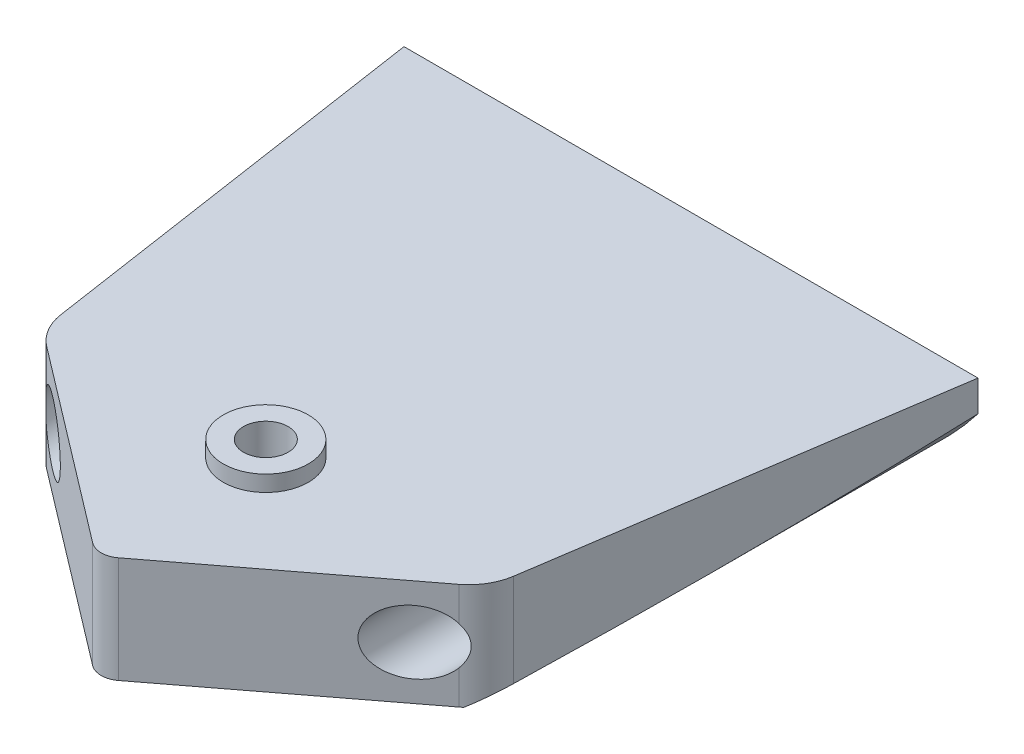
ISO-10303-21;
HEADER;
FILE_DESCRIPTION(('STEP AP214'),'2;1');
FILE_NAME('part.step','',(''),(''),'','','');
FILE_SCHEMA(('AUTOMOTIVE_DESIGN { 1 0 10303 214 1 1 1 1 }'));
ENDSEC;
DATA;
#1=APPLICATION_CONTEXT('core data for automotive mechanical design processes');
#2=APPLICATION_PROTOCOL_DEFINITION('international standard','automotive_design',2000,#1);
#3=PRODUCT_CONTEXT('',#1,'mechanical');
#4=PRODUCT('Part','Part','',(#3));
#5=PRODUCT_RELATED_PRODUCT_CATEGORY('part','',(#4));
#6=PRODUCT_DEFINITION_FORMATION('','',#4);
#7=PRODUCT_DEFINITION_CONTEXT('part definition',#1,'design');
#8=PRODUCT_DEFINITION('design','',#6,#7);
#9=PRODUCT_DEFINITION_SHAPE('','',#8);
#10=(LENGTH_UNIT() NAMED_UNIT(*) SI_UNIT(.MILLI.,.METRE.));
#11=(NAMED_UNIT(*) PLANE_ANGLE_UNIT() SI_UNIT($,.RADIAN.));
#12=(NAMED_UNIT(*) SI_UNIT($,.STERADIAN.) SOLID_ANGLE_UNIT());
#13=UNCERTAINTY_MEASURE_WITH_UNIT(LENGTH_MEASURE(1.E-05),#10,'distance_accuracy_value','');
#14=(GEOMETRIC_REPRESENTATION_CONTEXT(3) GLOBAL_UNCERTAINTY_ASSIGNED_CONTEXT((#13)) GLOBAL_UNIT_ASSIGNED_CONTEXT((#10,
#11,#12)) REPRESENTATION_CONTEXT('',''));
#15=CARTESIAN_POINT('',(0.,0.,0.));
#16=DIRECTION('',(0.,0.,1.));
#17=DIRECTION('',(1.,0.,0.));
#18=AXIS2_PLACEMENT_3D('',#15,#16,#17);
#19=CARTESIAN_POINT('',(16.356230590798,10.,-2.74778463224808));
#20=DIRECTION('',(0.,-1.,0.));
#21=DIRECTION('',(0.,0.,-1.));
#22=AXIS2_PLACEMENT_3D('',#19,#20,#21);
#23=CYLINDRICAL_SURFACE('',#22,5.);
#24=DIRECTION('',(0.,-1.,0.));
#25=VECTOR('',#24,1.);
#26=CARTESIAN_POINT('',(19.3864466671123,10.,1.22937396791443));
#27=LINE('',#26,#25);
#28=CARTESIAN_POINT('',(19.3864466671123,10.,1.22937396791443));
#29=VERTEX_POINT('',#28);
#30=CARTESIAN_POINT('',(19.3864466671123,6.81793077564261,1.22937396791443));
#31=VERTEX_POINT('',#30);
#32=EDGE_CURVE('E154',#29,#31,#27,.T.);
#33=ORIENTED_EDGE('',*,*,#32,.T.);
#34=CARTESIAN_POINT('',(20.,5.,0.676093942199916));
#35=CARTESIAN_POINT('',(19.9999993974469,4.93000132282489,0.676095101304906));
#36=CARTESIAN_POINT('',(19.9975431321247,4.85997587815813,0.678714375850859));
#37=CARTESIAN_POINT('',(19.9877798434168,4.72060918613553,0.68905966577278));
#38=CARTESIAN_POINT('',(19.9804688992185,4.65126853782239,0.696789808847428));
#39=CARTESIAN_POINT('',(19.9611481971116,4.5137546289089,0.717004483014388));
#40=CARTESIAN_POINT('',(19.9491255329144,4.44558511626353,0.729502070510012));
#41=CARTESIAN_POINT('',(19.9206383145574,4.31108371986168,0.75869688514436));
#42=CARTESIAN_POINT('',(19.9041711962837,4.24475292133981,0.775396536178239));
#43=CARTESIAN_POINT('',(19.8490243221536,4.05081822727424,0.830351308871281));
#44=CARTESIAN_POINT('',(19.8043152473006,3.92634928773405,0.87377689463278));
#45=CARTESIAN_POINT('',(19.7007393345052,3.68736194584191,0.969637073616236));
#46=CARTESIAN_POINT('',(19.6418688008502,3.57284615159738,1.02207401750838));
#47=CARTESIAN_POINT('',(19.5291009910011,3.38375517343911,1.11702705391172));
#48=CARTESIAN_POINT('',(19.4781908108222,3.30677556446041,1.15837288599055));
#49=CARTESIAN_POINT('',(19.3699427894173,3.15831275422242,1.24248260842672));
#50=CARTESIAN_POINT('',(19.3126053684656,3.08682919409389,1.28524640593537));
#51=CARTESIAN_POINT('',(19.1916651398428,2.94939139636904,1.37117456174107));
#52=CARTESIAN_POINT('',(19.1280522921305,2.88344634234557,1.4143394584648));
#53=CARTESIAN_POINT('',(18.9948367199818,2.75744982844986,1.50004197199427));
#54=CARTESIAN_POINT('',(18.9252337849129,2.69739857598338,1.54257956668023));
#55=CARTESIAN_POINT('',(18.7798545167759,2.58324544102927,1.6263577690504));
#56=CARTESIAN_POINT('',(18.7040477130156,2.52917642224878,1.66759040190652));
#57=CARTESIAN_POINT('',(18.5468395013849,2.42783514629488,1.74765899097899));
#58=CARTESIAN_POINT('',(18.4654390427897,2.38056174005668,1.78649535174373));
#59=CARTESIAN_POINT('',(18.297526743819,2.29346227990997,1.86087870118924));
#60=CARTESIAN_POINT('',(18.2110250187495,2.25362209950722,1.89643186309609));
#61=CARTESIAN_POINT('',(18.0333253143926,2.18194697028742,1.96351911515419));
#62=CARTESIAN_POINT('',(17.9421290930828,2.150109050712,1.99505469464187));
#63=CARTESIAN_POINT('',(17.7096156229509,2.08152829466317,2.06776944362323));
#64=CARTESIAN_POINT('',(17.56574556894,2.05009999078634,2.10604268029544));
#65=CARTESIAN_POINT('',(17.272272663749,2.00871111651952,2.16987756472056));
#66=CARTESIAN_POINT('',(17.1226736277027,1.99873650393735,2.19544751878185));
#67=CARTESIAN_POINT('',(16.8215278055031,2.00152295265526,2.23283408307928));
#68=CARTESIAN_POINT('',(16.6699769322821,2.01434386298057,2.24461435417014));
#69=CARTESIAN_POINT('',(16.3701412758237,2.06293489188173,2.25444698403186));
#70=CARTESIAN_POINT('',(16.2218569533915,2.09870822713232,2.25249741824834));
#71=CARTESIAN_POINT('',(15.9388295082857,2.19016576518199,2.23670046267233));
#72=CARTESIAN_POINT('',(15.8037824603238,2.2450024910493,2.22332882476823));
#73=CARTESIAN_POINT('',(15.5440132421125,2.37300787958205,2.18754870760884));
#74=CARTESIAN_POINT('',(15.4192931141028,2.44618015679971,2.16513844600604));
#75=CARTESIAN_POINT('',(15.1737108926503,2.6149441471233,2.11211087319347));
#76=CARTESIAN_POINT('',(15.0538232473893,2.71179730608136,2.08100765069247));
#77=CARTESIAN_POINT('',(14.8306854873223,2.92211386327128,2.01522609542066));
#78=CARTESIAN_POINT('',(14.7274475286272,3.0355892832752,1.9805451805585));
#79=CARTESIAN_POINT('',(14.5292878906621,3.28994311019219,1.90781193366732));
#80=CARTESIAN_POINT('',(14.436441959131,3.43245485812519,1.86979644618787));
#81=CARTESIAN_POINT('',(14.2756541295181,3.73239572088573,1.7996263303618));
#82=CARTESIAN_POINT('',(14.2077096275669,3.88982327384345,1.76747108940326));
#83=CARTESIAN_POINT('',(14.1265975036978,4.13348271070634,1.727661653717));
#84=CARTESIAN_POINT('',(14.1030665339883,4.21570280012384,1.71581833466288));
#85=CARTESIAN_POINT('',(14.0630510133267,4.38222175984718,1.69539406194695));
#86=CARTESIAN_POINT('',(14.0465629791914,4.46651958071168,1.6868114958665));
#87=CARTESIAN_POINT('',(14.0208709466472,4.63645211292635,1.67333613826538));
#88=CARTESIAN_POINT('',(14.0116616892579,4.72208581339038,1.66844068289534));
#89=CARTESIAN_POINT('',(14.0006376802573,4.89393351375747,1.66256803886644));
#90=CARTESIAN_POINT('',(13.9988221049151,4.9801474479446,1.66159041372197));
#91=CARTESIAN_POINT('',(14.0041251033631,5.21926967372333,1.66443573024804));
#92=CARTESIAN_POINT('',(14.0192654579563,5.37204202487723,1.67257024075559));
#93=CARTESIAN_POINT('',(14.0723412685899,5.67241427682777,1.7002145739804));
#94=CARTESIAN_POINT('',(14.1102839820175,5.82001251500593,1.71972801825234));
#95=CARTESIAN_POINT('',(14.207436768647,6.1065654189318,1.76725561346818));
#96=CARTESIAN_POINT('',(14.2666524912661,6.24551777710485,1.795272022215));
#97=CARTESIAN_POINT('',(14.4046369545533,6.51217035875986,1.85623097682806));
#98=CARTESIAN_POINT('',(14.483414476821,6.63986549371659,1.88917573245883));
#99=CARTESIAN_POINT('',(14.6689040042983,6.89570668069635,1.96006610244715));
#100=CARTESIAN_POINT('',(14.7777728603597,7.02225573078459,1.99815463528812));
#101=CARTESIAN_POINT('',(15.0156344000806,7.25612918936713,2.07074807818289));
#102=CARTESIAN_POINT('',(15.1446341818235,7.36344678814568,2.10525171704194));
#103=CARTESIAN_POINT('',(15.423760181805,7.5583517074343,2.16662440741116));
#104=CARTESIAN_POINT('',(15.5743489861411,7.64535261131812,2.19327130637569));
#105=CARTESIAN_POINT('',(15.889775616096,7.79241679594213,2.23293628521623));
#106=CARTESIAN_POINT('',(16.0545980348459,7.85250877831343,2.2459689062501));
#107=CARTESIAN_POINT('',(16.3751174260343,7.93839182136112,2.25447881427759));
#108=CARTESIAN_POINT('',(16.5299925499592,7.96708993082903,2.2516338935692));
#109=CARTESIAN_POINT('',(16.841323905082,7.99988225102629,2.23106872429357));
#110=CARTESIAN_POINT('',(16.9977795591334,8.00398513923632,2.21335372457855));
#111=CARTESIAN_POINT('',(17.2961148322937,7.98882221783853,2.16524451636849));
#112=CARTESIAN_POINT('',(17.4382437645317,7.97118555640931,2.1358336036666));
#113=CARTESIAN_POINT('',(17.7159102799631,7.91676217162201,2.06592335969867));
#114=CARTESIAN_POINT('',(17.8514465600182,7.87997167890167,2.02542184661114));
#115=CARTESIAN_POINT('',(18.1219291937254,7.78623268230743,1.9323955428482));
#116=CARTESIAN_POINT('',(18.2562583273249,7.72812410147463,1.87925805498857));
#117=CARTESIAN_POINT('',(18.5126409460488,7.59476955184889,1.76548504089575));
#118=CARTESIAN_POINT('',(18.6346876249305,7.51951415582848,1.70484539843109));
#119=CARTESIAN_POINT('',(18.8840899904943,7.34039722151981,1.56883674752615));
#120=CARTESIAN_POINT('',(19.0091009424804,7.23387626887139,1.4926732674037));
#121=CARTESIAN_POINT('',(19.2399782771683,7.00231610613562,1.33917367646108));
#122=CARTESIAN_POINT('',(19.3458272365332,6.87726022889047,1.2618365670509));
#123=CARTESIAN_POINT('',(19.5301687195809,6.61913734302005,1.11729504461045));
#124=CARTESIAN_POINT('',(19.6100661065841,6.4872614973442,1.04976080889622));
#125=CARTESIAN_POINT('',(19.7500897018424,6.20879673154875,0.925155598214386));
#126=CARTESIAN_POINT('',(19.8102461492115,6.06223076759516,0.868068679977664));
#127=CARTESIAN_POINT('',(19.8955408027383,5.79399833188219,0.784345228172444));
#128=CARTESIAN_POINT('',(19.9256662691521,5.67519533246061,0.753667010208037));
#129=CARTESIAN_POINT('',(19.971250829043,5.43222033564827,0.706595300910961));
#130=CARTESIAN_POINT('',(19.9867591219084,5.30806783043904,0.690153905702406));
#131=CARTESIAN_POINT('',(19.9962711272586,5.15264353336854,0.68005782331395));
#132=CARTESIAN_POINT('',(19.9976678214336,5.12215694085815,0.67857422930864));
#133=CARTESIAN_POINT('',(19.9995324665974,5.06111527326198,0.676591953795438));
#134=CARTESIAN_POINT('',(20.000000263064,5.03056018762858,0.676093436155124));
#135=CARTESIAN_POINT('',(20.,5.,0.676093942199916));
#136=B_SPLINE_CURVE_WITH_KNOTS('',3,(#34,#35,#36,#37,#38,#39,#40,#41,#42,#43,#44,#45,#46,#47,
#48,#49,#50,#51,#52,#53,#54,#55,#56,#57,#58,#59,#60,#61,#62,#63,#64,#65,#66,#67,#68,#69,#70,#71,
#72,#73,#74,#75,#76,#77,#78,#79,#80,#81,#82,#83,#84,#85,#86,#87,#88,#89,#90,#91,#92,#93,#94,#95,
#96,#97,#98,#99,#100,#101,#102,#103,#104,#105,#106,#107,#108,#109,#110,#111,#112,#113,#114,#115,
#116,#117,#118,#119,#120,#121,#122,#123,#124,#125,#126,#127,#128,#129,#130,#131,#132,#133,#134,
#135),.UNSPECIFIED.,.T.,.F.,(4,2,2,2,2,2,2,2,2,2,2,2,2,2,2,2,2,2,2,2,2,2,2,2,2,2,2,2,2,2,2,2,2,
2,2,2,2,2,2,2,2,2,2,2,2,2,2,2,2,2,4),(0.,0.209952221926045,0.420074215358737,0.630775841241275,
0.841599286831708,1.25741826439102,1.67334587608568,1.97638218389987,2.27939868786374,
2.58290810180431,2.88642819256238,3.19154058066048,3.49660131670595,3.80107625861338,
4.10543799976923,4.55978665811277,5.01383783873524,5.46908287926365,5.92439173418987,
6.36161215035508,6.79891882523043,7.26870332175397,7.73882927509829,8.25931950533066,
8.77975529388707,9.0384558960775,9.2970284056832,9.55541392315592,9.8137706530877,
10.2725151434582,10.7314057174379,11.190418247977,11.6496372101652,12.1610286797529,
12.672600873034,13.1974917813909,13.7218214884967,14.1918681102625,14.6617488843377,
15.0984608512988,15.5352587931314,16.0005977594098,16.4661931865627,17.0072395614245,
17.5487754467983,18.052031375895,18.5545127810108,18.932125271155,19.3084621826886,
19.4001083750035,19.491769811391),.UNSPECIFIED.);
#137=CARTESIAN_POINT('',(19.3864466671123,3.18206922435739,1.22937396791443));
#138=VERTEX_POINT('',#137);
#139=EDGE_CURVE('E46',#31,#138,#136,.T.);
#140=ORIENTED_EDGE('',*,*,#139,.T.);
#141=CARTESIAN_POINT('',(19.3864466671123,0.,1.22937396791443));
#142=VERTEX_POINT('',#141);
#143=EDGE_CURVE('E153',#138,#142,#27,.T.);
#144=ORIENTED_EDGE('',*,*,#143,.T.);
#145=CARTESIAN_POINT('',(16.356230590798,0.,-2.74778463224808));
#146=DIRECTION('',(0.,1.,0.));
#147=DIRECTION('',(0.,0.,1.));
#148=AXIS2_PLACEMENT_3D('',#145,#146,#147);
#149=CIRCLE('',#148,5.);
#150=CARTESIAN_POINT('',(19.6452920568771,0.,1.01812490893232));
#151=VERTEX_POINT('',#150);
#152=EDGE_CURVE('E233',#151,#142,#149,.F.);
#153=ORIENTED_EDGE('',*,*,#152,.F.);
#154=CARTESIAN_POINT('',(19.6452920568771,0.,1.01812490893233));
#155=CARTESIAN_POINT('',(19.744410795043,0.0701669145422149,0.931535959530812));
#156=CARTESIAN_POINT('',(19.8406012512899,0.139065092445717,0.840642917267399));
#157=CARTESIAN_POINT('',(20.0266309555898,0.273696856069786,0.650149655721552));
#158=CARTESIAN_POINT('',(20.1164624831586,0.339426565039006,0.550539169638526));
#159=CARTESIAN_POINT('',(20.3766818732594,0.531671265899067,0.237179422895715));
#160=CARTESIAN_POINT('',(20.5362184895519,0.652117519348152,0.0102604306303202));
#161=CARTESIAN_POINT('',(20.7947279343868,0.850162833520079,-0.433939225384568));
#162=CARTESIAN_POINT('',(20.8993967186807,0.931568005842924,-0.646179866172098));
#163=CARTESIAN_POINT('',(21.0340685525703,1.03724668912444,-0.978029010686288));
#164=CARTESIAN_POINT('',(21.0751731276617,1.06968285626978,-1.09063862615373));
#165=CARTESIAN_POINT('',(21.1495252938964,1.12858318311936,-1.31991155918172));
#166=CARTESIAN_POINT('',(21.1827775115843,1.15505085899315,-1.43657244305314));
#167=CARTESIAN_POINT('',(21.2300266833348,1.19276918556885,-1.62888994020487));
#168=CARTESIAN_POINT('',(21.2465716411742,1.20600695384003,-1.70354536290267));
#169=CARTESIAN_POINT('',(21.2762978411811,1.22982838617091,-1.85401229526224));
#170=CARTESIAN_POINT('',(21.289476032029,1.24040964246975,-1.92982478811427));
#171=CARTESIAN_POINT('',(21.3009123551395,1.24960127019474,-2.00608236759688));
#172=B_SPLINE_CURVE_WITH_KNOTS('',3,(#154,#155,#156,#157,#158,#159,#160,#161,#162,#163,#164,
#165,#166,#167,#168,#169,#170,#171),.UNSPECIFIED.,.F.,.F.,(4,2,2,2,2,2,2,2,4),(0.,
0.44724176256425,0.895017532405365,1.79759008222598,2.54512287008426,2.91730280309122,
3.28926290053967,3.5219594675864,3.75486618661724),.UNSPECIFIED.);
#173=CARTESIAN_POINT('',(21.3009123551395,1.24960127019475,-2.00608236759688));
#174=VERTEX_POINT('',#173);
#175=EDGE_CURVE('E188',#151,#174,#172,.T.);
#176=ORIENTED_EDGE('',*,*,#175,.T.);
#177=DIRECTION('',(0.,-1.,0.));
#178=VECTOR('',#177,1.);
#179=CARTESIAN_POINT('',(21.3009123551395,10.,-2.00608236759688));
#180=LINE('',#179,#178);
#181=CARTESIAN_POINT('',(21.3009123551395,10.,-2.00608236759688));
#182=VERTEX_POINT('',#181);
#183=EDGE_CURVE('E150',#182,#174,#180,.T.);
#184=ORIENTED_EDGE('',*,*,#183,.F.);
#185=CARTESIAN_POINT('',(16.356230590798,10.,-2.74778463224808));
#186=DIRECTION('',(0.,1.,0.));
#187=DIRECTION('',(0.,0.,1.));
#188=AXIS2_PLACEMENT_3D('',#185,#186,#187);
#189=CIRCLE('',#188,5.);
#190=EDGE_CURVE('E212',#182,#29,#189,.F.);
#191=ORIENTED_EDGE('',*,*,#190,.T.);
#192=EDGE_LOOP('',(#33,#140,#144,#153,#176,#184,#191));
#193=FACE_BOUND('',#192,.T.);
#194=ADVANCED_FACE('F33',(#193),#23,.T.);
#195=CARTESIAN_POINT('',(-16.356230590798,10.,-2.74778463224807));
#196=DIRECTION('',(0.,-1.,0.));
#197=DIRECTION('',(0.,0.,-1.));
#198=AXIS2_PLACEMENT_3D('',#195,#196,#197);
#199=CYLINDRICAL_SURFACE('',#198,5.);
#200=CARTESIAN_POINT('',(-14.,4.99999999999999,1.66222414359212));
#201=CARTESIAN_POINT('',(-14.0000010269064,5.07930266730833,1.66222538802253));
#202=CARTESIAN_POINT('',(-14.0031514871112,5.15863342453922,1.66391335650946));
#203=CARTESIAN_POINT('',(-14.0157045375727,5.31667359919328,1.67058366540975));
#204=CARTESIAN_POINT('',(-14.0251110836195,5.39538259158443,1.67556809019661));
#205=CARTESIAN_POINT('',(-14.0626237725049,5.6299714174501,1.69521304286504));
#206=CARTESIAN_POINT('',(-14.1000225744231,5.78408772681164,1.71456439003316));
#207=CARTESIAN_POINT('',(-14.1976302648397,6.08225542325466,1.76257318401358));
#208=CARTESIAN_POINT('',(-14.2577183328398,6.22635541672138,1.79118122537424));
#209=CARTESIAN_POINT('',(-14.3987945771176,6.50259048215437,1.85377923323448));
#210=CARTESIAN_POINT('',(-14.4797814379331,6.6347263064913,1.88776886094124));
#211=CARTESIAN_POINT('',(-14.6678229870792,6.89435245369333,1.95967255444117));
#212=CARTESIAN_POINT('',(-14.7763966120978,7.02071645861091,1.99768804455688));
#213=CARTESIAN_POINT('',(-15.0136004579714,7.25431281939866,2.07017322173365));
#214=CARTESIAN_POINT('',(-15.142237373957,7.36153876318226,2.10464171876532));
#215=CARTESIAN_POINT('',(-15.4208753115865,7.55657331933139,2.16607362757925));
#216=CARTESIAN_POINT('',(-15.571376324542,7.6437494160538,2.19279810525615));
#217=CARTESIAN_POINT('',(-15.8866668506461,7.79117980697994,2.23264244246433));
#218=CARTESIAN_POINT('',(-16.0514412543997,7.85146216410088,2.24577650222002));
#219=CARTESIAN_POINT('',(-16.3719506154221,7.93771988439773,2.25449028188348));
#220=CARTESIAN_POINT('',(-16.5268609857597,7.96659595676153,2.25174325585441));
#221=CARTESIAN_POINT('',(-16.8382982484249,7.99972428451077,2.23136400927098));
#222=CARTESIAN_POINT('',(-16.9948245356078,8.00398544514597,2.21373717461984));
#223=CARTESIAN_POINT('',(-17.2932665595794,7.98910380428257,2.16578883148339));
#224=CARTESIAN_POINT('',(-17.4354309785785,7.97160005844577,2.13645673841818));
#225=CARTESIAN_POINT('',(-17.7131884048834,7.91742987172157,2.06669211968573));
#226=CARTESIAN_POINT('',(-17.8487801224044,7.88075968623639,2.02625742560711));
#227=CARTESIAN_POINT('',(-18.1193338031368,7.78727438498188,1.9333733211099));
#228=CARTESIAN_POINT('',(-18.2536836678149,7.72930622238036,1.88031442469771));
#229=CARTESIAN_POINT('',(-18.5101267672858,7.59623148842157,1.76668538431361));
#230=CARTESIAN_POINT('',(-18.6322132343986,7.52111552789376,1.70611113368202));
#231=CARTESIAN_POINT('',(-18.8816972121025,7.34231599614864,1.57023683775908));
#232=CARTESIAN_POINT('',(-19.0067558439397,7.23597640615495,1.4941402427226));
#233=CARTESIAN_POINT('',(-19.2377619482196,7.00478635198602,1.3407376395698));
#234=CARTESIAN_POINT('',(-19.3436911898617,6.87991843409436,1.26343055326146));
#235=CARTESIAN_POINT('',(-19.528397412501,6.62192088079657,1.1187575447036));
#236=CARTESIAN_POINT('',(-19.6085415196289,6.48995163806453,1.05107362441783));
#237=CARTESIAN_POINT('',(-19.7489936599538,6.21131049261953,0.926173956190942));
#238=CARTESIAN_POINT('',(-19.809338469982,6.06466651707345,0.868938888469126));
#239=CARTESIAN_POINT('',(-19.8946083851775,5.79723689278453,0.78527580545077));
#240=CARTESIAN_POINT('',(-19.9246421558655,5.6793988288082,0.754713506868082));
#241=CARTESIAN_POINT('',(-19.9703327879988,5.43830890250926,0.707554247020058));
#242=CARTESIAN_POINT('',(-19.9860131848278,5.31506625120355,0.690934427871454));
#243=CARTESIAN_POINT('',(-20.0018882750534,5.06577006319378,0.674106265502904));
#244=CARTESIAN_POINT('',(-20.0020028045651,4.93970531946526,0.673982878610391));
#245=CARTESIAN_POINT('',(-19.9865359193188,4.68961421358181,0.690381935539801));
#246=CARTESIAN_POINT('',(-19.9709413019111,4.56558965519583,0.70691838101016));
#247=CARTESIAN_POINT('',(-19.9216973503185,4.30428566031893,0.757761547196245));
#248=CARTESIAN_POINT('',(-19.8856197965208,4.16793980787045,0.794429579683654));
#249=CARTESIAN_POINT('',(-19.7965906476222,3.90527924065552,0.880956123876732));
#250=CARTESIAN_POINT('',(-19.7436020364246,3.77898729744323,0.930843530027995));
#251=CARTESIAN_POINT('',(-19.6020232484332,3.49585985488908,1.05702746961611));
#252=CARTESIAN_POINT('',(-19.5074563579144,3.3434464669489,1.13650748165655));
#253=CARTESIAN_POINT('',(-19.294466806158,3.05911917143385,1.30003853992087));
#254=CARTESIAN_POINT('',(-19.1760183247702,2.92722772746654,1.38409446107139));
#255=CARTESIAN_POINT('',(-18.9148701658629,2.68362228792308,1.55078853856915));
#256=CARTESIAN_POINT('',(-18.7718355430567,2.57223810029403,1.63338692804282));
#257=CARTESIAN_POINT('',(-18.4645219833014,2.37543665863448,1.78924778698242));
#258=CARTESIAN_POINT('',(-18.3002808278323,2.28997410847918,1.86252641035856));
#259=CARTESIAN_POINT('',(-17.9896871336928,2.16407624362888,1.9801541883383));
#260=CARTESIAN_POINT('',(-17.8467114266216,2.11797423387657,2.02735059291752));
#261=CARTESIAN_POINT('',(-17.552131878844,2.04736746692249,2.10949163535748));
#262=CARTESIAN_POINT('',(-17.4005338451086,2.02284835319712,2.14444440811317));
#263=CARTESIAN_POINT('',(-17.0920662677577,1.99740704828236,2.20026608600103));
#264=CARTESIAN_POINT('',(-16.9351764937017,1.99658898130594,2.22107245236215));
#265=CARTESIAN_POINT('',(-16.6219496007695,2.01977811628786,2.24762148675766));
#266=CARTESIAN_POINT('',(-16.4656124149112,2.04378219809499,2.25336604774442));
#267=CARTESIAN_POINT('',(-16.1701361735526,2.11336343558365,2.25077640718044));
#268=CARTESIAN_POINT('',(-16.030577351683,2.1572264952182,2.24344532791328));
#269=CARTESIAN_POINT('',(-15.7601329041393,2.26432938215951,2.21841355125494));
#270=CARTESIAN_POINT('',(-15.6292485286809,2.32757199521457,2.20071136271643));
#271=CARTESIAN_POINT('',(-15.3734320810946,2.47472483783883,2.15646940019206));
#272=CARTESIAN_POINT('',(-15.2490182431986,2.55942454200436,2.12957382052291));
#273=CARTESIAN_POINT('',(-15.0149457055853,2.74568092858098,2.07046733044984));
#274=CARTESIAN_POINT('',(-14.9052940022457,2.84724555339332,2.0382539156954));
#275=CARTESIAN_POINT('',(-14.691117689787,3.07737830792401,1.96830174483679));
#276=CARTESIAN_POINT('',(-14.5885420013174,3.20769669102178,1.93034819090463));
#277=CARTESIAN_POINT('',(-14.4058086937801,3.4842109614563,1.85716686342699));
#278=CARTESIAN_POINT('',(-14.3256718832101,3.63042141292632,1.82194164172572));
#279=CARTESIAN_POINT('',(-14.2228781308978,3.86197210587201,1.77441616927708));
#280=CARTESIAN_POINT('',(-14.1911090746344,3.94278318336381,1.75923604964365));
#281=CARTESIAN_POINT('',(-14.1345894390841,4.10726741876688,1.73164633800074));
#282=CARTESIAN_POINT('',(-14.1098353364898,4.1909391161628,1.7192353558419));
#283=CARTESIAN_POINT('',(-14.0677044726407,4.36028299626202,1.69779815013542));
#284=CARTESIAN_POINT('',(-14.0503068241183,4.44594877641388,1.68876235202283));
#285=CARTESIAN_POINT('',(-14.0230425007943,4.61873748410673,1.67448552706026));
#286=CARTESIAN_POINT('',(-14.0131696985286,4.70585916689961,1.66924141283043));
#287=CARTESIAN_POINT('',(-14.0047549598099,4.82767067415789,1.66476191090301));
#288=CARTESIAN_POINT('',(-14.0029726118795,4.86210310367952,1.66381130555548));
#289=CARTESIAN_POINT('',(-14.0005948868218,4.93102191624644,1.66254213964972));
#290=CARTESIAN_POINT('',(-13.99999955336,4.96550830122984,1.66222360234274));
#291=CARTESIAN_POINT('',(-14.,4.99999999999999,1.66222414359212));
#292=B_SPLINE_CURVE_WITH_KNOTS('',3,(#200,#201,#202,#203,#204,#205,#206,#207,#208,#209,#210,
#211,#212,#213,#214,#215,#216,#217,#218,#219,#220,#221,#222,#223,#224,#225,#226,#227,#228,#229,
#230,#231,#232,#233,#234,#235,#236,#237,#238,#239,#240,#241,#242,#243,#244,#245,#246,#247,#248,
#249,#250,#251,#252,#253,#254,#255,#256,#257,#258,#259,#260,#261,#262,#263,#264,#265,#266,#267,
#268,#269,#270,#271,#272,#273,#274,#275,#276,#277,#278,#279,#280,#281,#282,#283,#284,#285,#286,
#287,#288,#289,#290,#291),.UNSPECIFIED.,.T.,.F.,(4,2,2,2,2,2,2,2,2,2,2,2,2,2,2,2,2,2,2,2,2,2,2,
2,2,2,2,2,2,2,2,2,2,2,2,2,2,2,2,2,2,2,2,2,2,4),(0.,0.237868438454364,0.475887426853112,
0.952592044796527,1.42679320868532,1.90096453153912,2.41136502755076,2.92193621032446,
3.44689901467823,3.97131274538677,4.44155302308191,4.91162316530975,5.34834193783766,
5.78514606517321,6.25030150724779,6.71571225579869,7.25645469362784,7.79770978409905,
8.30170670779868,8.80476209554803,9.17947737771364,9.5535771287362,9.92960341287628,
10.3059459897323,10.7407469463842,11.1765062293275,11.7620445234319,12.3482193141189,
12.9431252581273,13.5369855785694,14.007417969407,14.4775372007637,14.949721463569,
15.4218463798915,15.8592927036639,16.2968019384557,16.7536351325592,17.210684082014,
17.7189104299353,18.22760652793,18.4917452176874,18.755751005931,19.0190020824119,
19.2820385644812,19.385492647566,19.488950536242),.UNSPECIFIED.);
#293=CARTESIAN_POINT('',(-19.3864466671123,6.8179307756426,1.22937396791443));
#294=VERTEX_POINT('',#293);
#295=CARTESIAN_POINT('',(-19.3864466671123,3.18206922435738,1.22937396791443));
#296=VERTEX_POINT('',#295);
#297=EDGE_CURVE('E53',#294,#296,#292,.T.);
#298=ORIENTED_EDGE('',*,*,#297,.F.);
#299=DIRECTION('',(0.,-1.,0.));
#300=VECTOR('',#299,1.);
#301=CARTESIAN_POINT('',(-19.3864466671123,10.,1.22937396791443));
#302=LINE('',#301,#300);
#303=CARTESIAN_POINT('',(-19.3864466671123,10.,1.22937396791443));
#304=VERTEX_POINT('',#303);
#305=EDGE_CURVE('E127',#304,#294,#302,.T.);
#306=ORIENTED_EDGE('',*,*,#305,.F.);
#307=CARTESIAN_POINT('',(-16.356230590798,10.,-2.74778463224807));
#308=DIRECTION('',(0.,1.,0.));
#309=DIRECTION('',(0.,0.,1.));
#310=AXIS2_PLACEMENT_3D('',#307,#308,#309);
#311=CIRCLE('',#310,5.);
#312=CARTESIAN_POINT('',(-21.3009123551395,10.,-2.00608236759687));
#313=VERTEX_POINT('',#312);
#314=EDGE_CURVE('E222',#313,#304,#311,.T.);
#315=ORIENTED_EDGE('',*,*,#314,.F.);
#316=DIRECTION('',(0.,-1.,0.));
#317=VECTOR('',#316,1.);
#318=CARTESIAN_POINT('',(-21.3009123551395,10.,-2.00608236759687));
#319=LINE('',#318,#317);
#320=CARTESIAN_POINT('',(-21.3009123551395,1.24960127019474,-2.00608236759687));
#321=VERTEX_POINT('',#320);
#322=EDGE_CURVE('E136',#313,#321,#319,.T.);
#323=ORIENTED_EDGE('',*,*,#322,.T.);
#324=CARTESIAN_POINT('',(-19.6452920568771,0.,1.01812490893233));
#325=CARTESIAN_POINT('',(-19.744410795043,0.0701669145422206,0.931535959530821));
#326=CARTESIAN_POINT('',(-19.8406012512898,0.139065092445723,0.840642917267407));
#327=CARTESIAN_POINT('',(-20.0266309555898,0.27369685606979,0.650149655721559));
#328=CARTESIAN_POINT('',(-20.1164624831586,0.339426565039006,0.550539169638531));
#329=CARTESIAN_POINT('',(-20.3766818732594,0.531671265899064,0.237179422895721));
#330=CARTESIAN_POINT('',(-20.5362184895519,0.652117519348155,0.0102604306303285));
#331=CARTESIAN_POINT('',(-20.7947279343868,0.850162833520074,-0.43393922538456));
#332=CARTESIAN_POINT('',(-20.8993967186807,0.931568005842909,-0.646179866172092));
#333=CARTESIAN_POINT('',(-21.0340685525703,1.03724668912444,-0.978029010686279));
#334=CARTESIAN_POINT('',(-21.0751731276617,1.06968285626978,-1.09063862615372));
#335=CARTESIAN_POINT('',(-21.1495252938964,1.12858318311936,-1.31991155918171));
#336=CARTESIAN_POINT('',(-21.1827775115843,1.15505085899314,-1.43657244305313));
#337=CARTESIAN_POINT('',(-21.2300266833348,1.19276918556884,-1.62888994020486));
#338=CARTESIAN_POINT('',(-21.2465716411742,1.20600695384003,-1.70354536290266));
#339=CARTESIAN_POINT('',(-21.2762978411811,1.22982838617092,-1.85401229526223));
#340=CARTESIAN_POINT('',(-21.289476032029,1.24040964246976,-1.92982478811425));
#341=CARTESIAN_POINT('',(-21.3009123551395,1.24960127019474,-2.00608236759686));
#342=B_SPLINE_CURVE_WITH_KNOTS('',3,(#324,#325,#326,#327,#328,#329,#330,#331,#332,#333,#334,
#335,#336,#337,#338,#339,#340,#341),.UNSPECIFIED.,.F.,.F.,(4,2,2,2,2,2,2,2,4),(0.,
0.447241762564253,0.895017532405369,1.79759008222598,2.54512287008426,2.91730280309122,
3.28926290053967,3.5219594675864,3.75486618661724),.UNSPECIFIED.);
#343=CARTESIAN_POINT('',(-19.6452920568771,0.,1.01812490893233));
#344=VERTEX_POINT('',#343);
#345=EDGE_CURVE('E260',#344,#321,#342,.T.);
#346=ORIENTED_EDGE('',*,*,#345,.F.);
#347=CARTESIAN_POINT('',(-16.356230590798,0.,-2.74778463224807));
#348=DIRECTION('',(0.,1.,0.));
#349=DIRECTION('',(0.,0.,1.));
#350=AXIS2_PLACEMENT_3D('',#347,#348,#349);
#351=CIRCLE('',#350,5.);
#352=CARTESIAN_POINT('',(-19.3864466671123,0.,1.22937396791443));
#353=VERTEX_POINT('',#352);
#354=EDGE_CURVE('E239',#344,#353,#351,.T.);
#355=ORIENTED_EDGE('',*,*,#354,.T.);
#356=EDGE_CURVE('E130',#296,#353,#302,.T.);
#357=ORIENTED_EDGE('',*,*,#356,.F.);
#358=EDGE_LOOP('',(#298,#306,#315,#323,#346,#355,#357));
#359=FACE_BOUND('',#358,.T.);
#360=ADVANCED_FACE('F125',(#359),#199,.T.);
#361=CARTESIAN_POINT('',(0.,10.,-40.));
#362=DIRECTION('',(0.,0.,-1.));
#363=DIRECTION('',(-1.,0.,0.));
#364=AXIS2_PLACEMENT_3D('',#361,#362,#363);
#365=PLANE('',#364);
#366=CARTESIAN_POINT('',(-17.,4.99999999999999,-40.));
#367=DIRECTION('',(0.,0.,-1.));
#368=DIRECTION('',(-1.,0.,0.));
#369=AXIS2_PLACEMENT_3D('',#366,#367,#368);
#370=CIRCLE('',#369,1.55);
#371=CARTESIAN_POINT('',(-18.55,4.99999999999999,-40.));
#372=VERTEX_POINT('',#371);
#373=EDGE_CURVE('E180',#372,#372,#370,.F.);
#374=ORIENTED_EDGE('',*,*,#373,.T.);
#375=EDGE_LOOP('',(#374));
#376=FACE_BOUND('',#375,.T.);
#377=CARTESIAN_POINT('',(17.,5.,-40.));
#378=DIRECTION('',(0.,0.,-1.));
#379=DIRECTION('',(-1.,0.,0.));
#380=AXIS2_PLACEMENT_3D('',#377,#378,#379);
#381=CIRCLE('',#380,1.55);
#382=CARTESIAN_POINT('',(15.45,5.,-40.));
#383=VERTEX_POINT('',#382);
#384=EDGE_CURVE('E182',#383,#383,#381,.T.);
#385=ORIENTED_EDGE('',*,*,#384,.F.);
#386=EDGE_LOOP('',(#385));
#387=FACE_BOUND('',#386,.T.);
#388=DIRECTION('',(0.,-1.,0.));
#389=VECTOR('',#388,1.);
#390=CARTESIAN_POINT('',(27.,10.,-40.));
#391=LINE('',#390,#389);
#392=CARTESIAN_POINT('',(27.,10.,-40.));
#393=VERTEX_POINT('',#392);
#394=CARTESIAN_POINT('',(27.,7.08602168022817,-40.));
#395=VERTEX_POINT('',#394);
#396=EDGE_CURVE('E147',#393,#395,#391,.T.);
#397=ORIENTED_EDGE('',*,*,#396,.T.);
#398=CARTESIAN_POINT('',(0.,27.75,-40.));
#399=DIRECTION('',(0.,0.,-1.));
#400=DIRECTION('',(-1.,0.,0.));
#401=AXIS2_PLACEMENT_3D('',#398,#399,#400);
#402=CIRCLE('',#401,34.);
#403=CARTESIAN_POINT('',(19.6452920568771,0.,-40.));
#404=VERTEX_POINT('',#403);
#405=EDGE_CURVE('E270',#395,#404,#402,.T.);
#406=ORIENTED_EDGE('',*,*,#405,.T.);
#407=DIRECTION('',(1.,0.,0.));
#408=VECTOR('',#407,1.);
#409=CARTESIAN_POINT('',(0.,0.,-40.));
#410=LINE('',#409,#408);
#411=CARTESIAN_POINT('',(-19.6452920568771,0.,-40.));
#412=VERTEX_POINT('',#411);
#413=EDGE_CURVE('E236',#412,#404,#410,.T.);
#414=ORIENTED_EDGE('',*,*,#413,.F.);
#415=CARTESIAN_POINT('',(-27.,7.08602168022818,-40.));
#416=VERTEX_POINT('',#415);
#417=EDGE_CURVE('E515',#412,#416,#402,.T.);
#418=ORIENTED_EDGE('',*,*,#417,.T.);
#419=DIRECTION('',(0.,-1.,0.));
#420=VECTOR('',#419,1.);
#421=CARTESIAN_POINT('',(-27.,10.,-40.));
#422=LINE('',#421,#420);
#423=CARTESIAN_POINT('',(-27.,10.,-40.));
#424=VERTEX_POINT('',#423);
#425=EDGE_CURVE('E139',#424,#416,#422,.T.);
#426=ORIENTED_EDGE('',*,*,#425,.F.);
#427=DIRECTION('',(1.,0.,0.));
#428=VECTOR('',#427,1.);
#429=CARTESIAN_POINT('',(0.,10.,-40.));
#430=LINE('',#429,#428);
#431=EDGE_CURVE('E217',#424,#393,#430,.T.);
#432=ORIENTED_EDGE('',*,*,#431,.T.);
#433=EDGE_LOOP('',(#397,#406,#414,#418,#426,#432));
#434=FACE_BOUND('',#433,.T.);
#435=ADVANCED_FACE('F330',(#376,#387,#434),#365,.T.);
#436=CARTESIAN_POINT('',(20.5378973105135,10.,3.08068459657701));
#437=DIRECTION('',(-0.988936352868298,0.,-0.148340452930244));
#438=DIRECTION('',(-0.148340452930244,0.,0.988936352868298));
#439=AXIS2_PLACEMENT_3D('',#436,#437,#438);
#440=PLANE('',#439);
#441=CARTESIAN_POINT('',(0.,27.75,140.));
#442=DIRECTION('',(-0.988936352868298,0.,-0.148340452930244));
#443=DIRECTION('',(0.148340452930244,0.,-0.988936352868298));
#444=AXIS2_PLACEMENT_3D('',#441,#442,#443);
#445=ELLIPSE('',#444,229.202482049776,34.);
#446=EDGE_CURVE('E183',#395,#174,#445,.T.);
#447=ORIENTED_EDGE('',*,*,#446,.F.);
#448=ORIENTED_EDGE('',*,*,#396,.F.);
#449=DIRECTION('',(0.148340452930244,0.,-0.988936352868298));
#450=VECTOR('',#449,1.);
#451=CARTESIAN_POINT('',(20.5378973105135,10.,3.08068459657701));
#452=LINE('',#451,#450);
#453=EDGE_CURVE('E215',#182,#393,#452,.T.);
#454=ORIENTED_EDGE('',*,*,#453,.F.);
#455=ORIENTED_EDGE('',*,*,#183,.T.);
#456=EDGE_LOOP('',(#447,#448,#454,#455));
#457=FACE_BOUND('',#456,.T.);
#458=ADVANCED_FACE('F450',(#457),#440,.F.);
#459=CARTESIAN_POINT('',(-20.5378973105135,10.,3.08068459657702));
#460=DIRECTION('',(0.988936352868298,0.,-0.148340452930245));
#461=DIRECTION('',(-0.148340452930245,0.,-0.988936352868298));
#462=AXIS2_PLACEMENT_3D('',#459,#460,#461);
#463=PLANE('',#462);
#464=CARTESIAN_POINT('',(0.,27.75,140.));
#465=DIRECTION('',(0.988936352868298,0.,-0.148340452930245));
#466=DIRECTION('',(-0.148340452930245,0.,-0.988936352868298));
#467=AXIS2_PLACEMENT_3D('',#464,#465,#466);
#468=ELLIPSE('',#467,229.202482049776,34.);
#469=EDGE_CURVE('E264',#321,#416,#468,.T.);
#470=ORIENTED_EDGE('',*,*,#469,.F.);
#471=ORIENTED_EDGE('',*,*,#322,.F.);
#472=DIRECTION('',(0.148340452930245,0.,0.988936352868298));
#473=VECTOR('',#472,1.);
#474=CARTESIAN_POINT('',(-20.5378973105135,10.,3.08068459657702));
#475=LINE('',#474,#473);
#476=EDGE_CURVE('E220',#424,#313,#475,.T.);
#477=ORIENTED_EDGE('',*,*,#476,.F.);
#478=ORIENTED_EDGE('',*,*,#425,.T.);
#479=EDGE_LOOP('',(#470,#471,#477,#478));
#480=FACE_BOUND('',#479,.T.);
#481=ADVANCED_FACE('F263',(#480),#463,.F.);
#482=CARTESIAN_POINT('',(0.,0.,0.));
#483=DIRECTION('',(0.,1.,0.));
#484=DIRECTION('',(0.,0.,1.));
#485=AXIS2_PLACEMENT_3D('',#482,#483,#484);
#486=PLANE('',#485);
#487=CARTESIAN_POINT('',(0.,0.,0.));
#488=DIRECTION('',(0.,1.,0.));
#489=DIRECTION('',(0.,0.,1.));
#490=AXIS2_PLACEMENT_3D('',#487,#488,#489);
#491=CIRCLE('',#490,4.);
#492=CARTESIAN_POINT('',(0.,0.,4.));
#493=VERTEX_POINT('',#492);
#494=EDGE_CURVE('E186',#493,#493,#491,.T.);
#495=ORIENTED_EDGE('',*,*,#494,.T.);
#496=EDGE_LOOP('',(#495));
#497=FACE_BOUND('',#496,.T.);
#498=DIRECTION('',(0.,0.,-1.));
#499=VECTOR('',#498,1.);
#500=CARTESIAN_POINT('',(19.6452920568771,0.,15.4856421366773));
#501=LINE('',#500,#499);
#502=EDGE_CURVE('E122',#151,#404,#501,.T.);
#503=ORIENTED_EDGE('',*,*,#502,.F.);
#504=ORIENTED_EDGE('',*,*,#152,.T.);
#505=DIRECTION('',(0.795431720032499,0.,-0.606043215262856));
#506=VECTOR('',#505,1.);
#507=CARTESIAN_POINT('',(7.71305595408895,0.,10.1233859397417));
#508=LINE('',#507,#506);
#509=CARTESIAN_POINT('',(1.21208643052572,0.,15.0765055767423));
#510=VERTEX_POINT('',#509);
#511=EDGE_CURVE('E230',#510,#142,#508,.T.);
#512=ORIENTED_EDGE('',*,*,#511,.F.);
#513=CARTESIAN_POINT('',(0.,0.,13.4856421366773));
#514=DIRECTION('',(0.,1.,0.));
#515=DIRECTION('',(0.,0.,1.));
#516=AXIS2_PLACEMENT_3D('',#513,#514,#515);
#517=CIRCLE('',#516,2.);
#518=CARTESIAN_POINT('',(-1.21208643052572,0.,15.0765055767423));
#519=VERTEX_POINT('',#518);
#520=EDGE_CURVE('E205',#510,#519,#517,.F.);
#521=ORIENTED_EDGE('',*,*,#520,.T.);
#522=DIRECTION('',(0.795431720032499,0.,0.606043215262856));
#523=VECTOR('',#522,1.);
#524=CARTESIAN_POINT('',(-7.71305595408895,0.,10.1233859397417));
#525=LINE('',#524,#523);
#526=EDGE_CURVE('E210',#353,#519,#525,.T.);
#527=ORIENTED_EDGE('',*,*,#526,.F.);
#528=ORIENTED_EDGE('',*,*,#354,.F.);
#529=DIRECTION('',(0.,0.,-1.));
#530=VECTOR('',#529,1.);
#531=CARTESIAN_POINT('',(-19.6452920568771,0.,15.4856421366773));
#532=LINE('',#531,#530);
#533=EDGE_CURVE('E159',#412,#344,#532,.F.);
#534=ORIENTED_EDGE('',*,*,#533,.F.);
#535=ORIENTED_EDGE('',*,*,#413,.T.);
#536=EDGE_LOOP('',(#503,#504,#512,#521,#527,#528,#534,#535));
#537=FACE_BOUND('',#536,.T.);
#538=ADVANCED_FACE('F247',(#497,#537),#486,.F.);
#539=CARTESIAN_POINT('',(0.,10.,13.4856421366773));
#540=DIRECTION('',(0.,-1.,0.));
#541=DIRECTION('',(0.,0.,-1.));
#542=AXIS2_PLACEMENT_3D('',#539,#540,#541);
#543=CYLINDRICAL_SURFACE('',#542,2.);
#544=ORIENTED_EDGE('',*,*,#520,.F.);
#545=DIRECTION('',(0.,-1.,0.));
#546=VECTOR('',#545,1.);
#547=CARTESIAN_POINT('',(1.21208643052572,10.,15.0765055767423));
#548=LINE('',#547,#546);
#549=CARTESIAN_POINT('',(1.21208643052572,10.,15.0765055767423));
#550=VERTEX_POINT('',#549);
#551=EDGE_CURVE('E157',#550,#510,#548,.T.);
#552=ORIENTED_EDGE('',*,*,#551,.F.);
#553=CARTESIAN_POINT('',(0.,10.,13.4856421366773));
#554=DIRECTION('',(0.,1.,0.));
#555=DIRECTION('',(0.,0.,1.));
#556=AXIS2_PLACEMENT_3D('',#553,#554,#555);
#557=CIRCLE('',#556,2.);
#558=CARTESIAN_POINT('',(-1.21208643052572,10.,15.0765055767423));
#559=VERTEX_POINT('',#558);
#560=EDGE_CURVE('E206',#550,#559,#557,.F.);
#561=ORIENTED_EDGE('',*,*,#560,.T.);
#562=DIRECTION('',(0.,-1.,0.));
#563=VECTOR('',#562,1.);
#564=CARTESIAN_POINT('',(-1.21208643052572,10.,15.0765055767423));
#565=LINE('',#564,#563);
#566=EDGE_CURVE('E141',#559,#519,#565,.T.);
#567=ORIENTED_EDGE('',*,*,#566,.T.);
#568=EDGE_LOOP('',(#544,#552,#561,#567));
#569=FACE_BOUND('',#568,.T.);
#570=ADVANCED_FACE('F35',(#569),#543,.T.);
#571=CARTESIAN_POINT('',(7.71305595408895,10.,10.1233859397417));
#572=DIRECTION('',(-0.606043215262856,0.,-0.795431720032499));
#573=DIRECTION('',(-0.795431720032499,0.,0.606043215262856));
#574=AXIS2_PLACEMENT_3D('',#571,#572,#573);
#575=PLANE('',#574);
#576=CARTESIAN_POINT('',(17.,5.,3.04761904761905));
#577=DIRECTION('',(-0.606043215262856,0.,-0.795431720032499));
#578=DIRECTION('',(-0.795431720032499,0.,0.606043215262856));
#579=AXIS2_PLACEMENT_3D('',#576,#577,#578);
#580=ELLIPSE('',#579,3.77153679498403,3.);
#581=EDGE_CURVE('E11',#31,#138,#580,.F.);
#582=ORIENTED_EDGE('',*,*,#581,.F.);
#583=ORIENTED_EDGE('',*,*,#32,.F.);
#584=DIRECTION('',(0.795431720032499,0.,-0.606043215262856));
#585=VECTOR('',#584,1.);
#586=CARTESIAN_POINT('',(7.71305595408895,10.,10.1233859397417));
#587=LINE('',#586,#585);
#588=EDGE_CURVE('E209',#550,#29,#587,.T.);
#589=ORIENTED_EDGE('',*,*,#588,.F.);
#590=ORIENTED_EDGE('',*,*,#551,.T.);
#591=ORIENTED_EDGE('',*,*,#511,.T.);
#592=ORIENTED_EDGE('',*,*,#143,.F.);
#593=EDGE_LOOP('',(#582,#583,#589,#590,#591,#592));
#594=FACE_BOUND('',#593,.T.);
#595=ADVANCED_FACE('F326',(#594),#575,.F.);
#596=CARTESIAN_POINT('',(-7.71305595408895,10.,10.1233859397417));
#597=DIRECTION('',(0.606043215262856,0.,-0.795431720032499));
#598=DIRECTION('',(-0.795431720032499,0.,-0.606043215262856));
#599=AXIS2_PLACEMENT_3D('',#596,#597,#598);
#600=PLANE('',#599);
#601=CARTESIAN_POINT('',(-17.,4.99999999999999,3.04761904761905));
#602=DIRECTION('',(0.606043215262856,0.,-0.795431720032499));
#603=DIRECTION('',(0.795431720032499,0.,0.606043215262856));
#604=AXIS2_PLACEMENT_3D('',#601,#602,#603);
#605=ELLIPSE('',#604,3.77153679498403,3.);
#606=EDGE_CURVE('E41',#296,#294,#605,.F.);
#607=ORIENTED_EDGE('',*,*,#606,.F.);
#608=ORIENTED_EDGE('',*,*,#356,.T.);
#609=ORIENTED_EDGE('',*,*,#526,.T.);
#610=ORIENTED_EDGE('',*,*,#566,.F.);
#611=DIRECTION('',(0.795431720032499,0.,0.606043215262856));
#612=VECTOR('',#611,1.);
#613=CARTESIAN_POINT('',(-7.71305595408895,10.,10.1233859397417));
#614=LINE('',#613,#612);
#615=EDGE_CURVE('E135',#304,#559,#614,.T.);
#616=ORIENTED_EDGE('',*,*,#615,.F.);
#617=ORIENTED_EDGE('',*,*,#305,.T.);
#618=EDGE_LOOP('',(#607,#608,#609,#610,#616,#617));
#619=FACE_BOUND('',#618,.T.);
#620=ADVANCED_FACE('F133',(#619),#600,.F.);
#621=CARTESIAN_POINT('',(0.,10.,0.));
#622=DIRECTION('',(0.,1.,0.));
#623=DIRECTION('',(0.,0.,1.));
#624=AXIS2_PLACEMENT_3D('',#621,#622,#623);
#625=PLANE('',#624);
#626=ORIENTED_EDGE('',*,*,#560,.F.);
#627=ORIENTED_EDGE('',*,*,#588,.T.);
#628=ORIENTED_EDGE('',*,*,#190,.F.);
#629=ORIENTED_EDGE('',*,*,#453,.T.);
#630=ORIENTED_EDGE('',*,*,#431,.F.);
#631=ORIENTED_EDGE('',*,*,#476,.T.);
#632=ORIENTED_EDGE('',*,*,#314,.T.);
#633=ORIENTED_EDGE('',*,*,#615,.T.);
#634=EDGE_LOOP('',(#626,#627,#628,#629,#630,#631,#632,#633));
#635=FACE_BOUND('',#634,.T.);
#636=CARTESIAN_POINT('',(0.,10.,0.));
#637=DIRECTION('',(0.,1.,0.));
#638=DIRECTION('',(0.,0.,1.));
#639=AXIS2_PLACEMENT_3D('',#636,#637,#638);
#640=CIRCLE('',#639,4.);
#641=CARTESIAN_POINT('',(0.,10.,4.));
#642=VERTEX_POINT('',#641);
#643=EDGE_CURVE('E225',#642,#642,#640,.T.);
#644=ORIENTED_EDGE('',*,*,#643,.F.);
#645=EDGE_LOOP('',(#644));
#646=FACE_BOUND('',#645,.T.);
#647=ADVANCED_FACE('F252',(#635,#646),#625,.T.);
#648=CARTESIAN_POINT('',(0.,11.5,0.));
#649=DIRECTION('',(0.,-1.,0.));
#650=DIRECTION('',(0.,0.,-1.));
#651=AXIS2_PLACEMENT_3D('',#648,#649,#650);
#652=CYLINDRICAL_SURFACE('',#651,2.1);
#653=CARTESIAN_POINT('',(0.,3.5,0.));
#654=DIRECTION('',(0.,1.,0.));
#655=DIRECTION('',(0.,0.,1.));
#656=AXIS2_PLACEMENT_3D('',#653,#654,#655);
#657=CIRCLE('',#656,2.1);
#658=CARTESIAN_POINT('',(0.,3.5,2.1));
#659=VERTEX_POINT('',#658);
#660=EDGE_CURVE('E191',#659,#659,#657,.T.);
#661=ORIENTED_EDGE('',*,*,#660,.F.);
#662=EDGE_LOOP('',(#661));
#663=FACE_BOUND('',#662,.T.);
#664=CARTESIAN_POINT('',(0.,11.5,0.));
#665=DIRECTION('',(0.,1.,0.));
#666=DIRECTION('',(0.,0.,1.));
#667=AXIS2_PLACEMENT_3D('',#664,#665,#666);
#668=CIRCLE('',#667,2.1);
#669=CARTESIAN_POINT('',(0.,11.5,2.1));
#670=VERTEX_POINT('',#669);
#671=EDGE_CURVE('E197',#670,#670,#668,.T.);
#672=ORIENTED_EDGE('',*,*,#671,.T.);
#673=EDGE_LOOP('',(#672));
#674=FACE_BOUND('',#673,.T.);
#675=ADVANCED_FACE('F315',(#663,#674),#652,.F.);
#676=CARTESIAN_POINT('',(0.,11.5,0.));
#677=DIRECTION('',(0.,-1.,0.));
#678=DIRECTION('',(0.,0.,-1.));
#679=AXIS2_PLACEMENT_3D('',#676,#677,#678);
#680=CYLINDRICAL_SURFACE('',#679,4.);
#681=ORIENTED_EDGE('',*,*,#643,.T.);
#682=EDGE_LOOP('',(#681));
#683=FACE_BOUND('',#682,.T.);
#684=CARTESIAN_POINT('',(0.,11.5,0.));
#685=DIRECTION('',(0.,1.,0.));
#686=DIRECTION('',(0.,0.,1.));
#687=AXIS2_PLACEMENT_3D('',#684,#685,#686);
#688=CIRCLE('',#687,4.);
#689=CARTESIAN_POINT('',(0.,11.5,4.));
#690=VERTEX_POINT('',#689);
#691=EDGE_CURVE('E202',#690,#690,#688,.T.);
#692=ORIENTED_EDGE('',*,*,#691,.F.);
#693=EDGE_LOOP('',(#692));
#694=FACE_BOUND('',#693,.T.);
#695=ADVANCED_FACE('F311',(#683,#694),#680,.T.);
#696=CARTESIAN_POINT('',(0.,11.5,0.));
#697=DIRECTION('',(0.,1.,0.));
#698=DIRECTION('',(0.,0.,1.));
#699=AXIS2_PLACEMENT_3D('',#696,#697,#698);
#700=PLANE('',#699);
#701=ORIENTED_EDGE('',*,*,#671,.F.);
#702=EDGE_LOOP('',(#701));
#703=FACE_BOUND('',#702,.T.);
#704=ORIENTED_EDGE('',*,*,#691,.T.);
#705=EDGE_LOOP('',(#704));
#706=FACE_BOUND('',#705,.T.);
#707=ADVANCED_FACE('F307',(#703,#706),#700,.T.);
#708=CARTESIAN_POINT('',(0.,3.5,0.));
#709=DIRECTION('',(0.,-1.,0.));
#710=DIRECTION('',(0.,0.,-1.));
#711=AXIS2_PLACEMENT_3D('',#708,#709,#710);
#712=CYLINDRICAL_SURFACE('',#711,4.);
#713=CARTESIAN_POINT('',(0.,3.5,0.));
#714=DIRECTION('',(0.,1.,0.));
#715=DIRECTION('',(0.,0.,1.));
#716=AXIS2_PLACEMENT_3D('',#713,#714,#715);
#717=CIRCLE('',#716,4.);
#718=CARTESIAN_POINT('',(0.,3.5,4.));
#719=VERTEX_POINT('',#718);
#720=EDGE_CURVE('E194',#719,#719,#717,.T.);
#721=ORIENTED_EDGE('',*,*,#720,.T.);
#722=EDGE_LOOP('',(#721));
#723=FACE_BOUND('',#722,.T.);
#724=ORIENTED_EDGE('',*,*,#494,.F.);
#725=EDGE_LOOP('',(#724));
#726=FACE_BOUND('',#725,.T.);
#727=ADVANCED_FACE('F303',(#723,#726),#712,.F.);
#728=CARTESIAN_POINT('',(0.,3.5,0.));
#729=DIRECTION('',(0.,1.,0.));
#730=DIRECTION('',(0.,0.,1.));
#731=AXIS2_PLACEMENT_3D('',#728,#729,#730);
#732=PLANE('',#731);
#733=ORIENTED_EDGE('',*,*,#660,.T.);
#734=EDGE_LOOP('',(#733));
#735=FACE_BOUND('',#734,.T.);
#736=ORIENTED_EDGE('',*,*,#720,.F.);
#737=EDGE_LOOP('',(#736));
#738=FACE_BOUND('',#737,.T.);
#739=ADVANCED_FACE('F176',(#735,#738),#732,.F.);
#740=CARTESIAN_POINT('',(-17.,4.99999999999999,21.2));
#741=DIRECTION('',(0.,0.,-1.));
#742=DIRECTION('',(-1.,0.,0.));
#743=AXIS2_PLACEMENT_3D('',#740,#741,#742);
#744=CYLINDRICAL_SURFACE('',#743,1.55);
#745=CARTESIAN_POINT('',(-17.,4.99999999999999,-16.));
#746=DIRECTION('',(0.,0.,-1.));
#747=DIRECTION('',(-1.,0.,0.));
#748=AXIS2_PLACEMENT_3D('',#745,#746,#747);
#749=CIRCLE('',#748,1.55);
#750=CARTESIAN_POINT('',(-18.55,4.99999999999999,-16.));
#751=VERTEX_POINT('',#750);
#752=EDGE_CURVE('E131',#751,#751,#749,.T.);
#753=ORIENTED_EDGE('',*,*,#752,.F.);
#754=EDGE_LOOP('',(#753));
#755=FACE_BOUND('',#754,.T.);
#756=ORIENTED_EDGE('',*,*,#373,.F.);
#757=EDGE_LOOP('',(#756));
#758=FACE_BOUND('',#757,.T.);
#759=ADVANCED_FACE('F172',(#755,#758),#744,.F.);
#760=CARTESIAN_POINT('',(17.,5.,21.2));
#761=DIRECTION('',(0.,0.,-1.));
#762=DIRECTION('',(-1.,0.,0.));
#763=AXIS2_PLACEMENT_3D('',#760,#761,#762);
#764=CYLINDRICAL_SURFACE('',#763,1.55);
#765=CARTESIAN_POINT('',(17.,5.,-16.));
#766=DIRECTION('',(0.,0.,-1.));
#767=DIRECTION('',(-1.,0.,0.));
#768=AXIS2_PLACEMENT_3D('',#765,#766,#767);
#769=CIRCLE('',#768,1.55);
#770=CARTESIAN_POINT('',(15.45,5.,-16.));
#771=VERTEX_POINT('',#770);
#772=EDGE_CURVE('E162',#771,#771,#769,.F.);
#773=ORIENTED_EDGE('',*,*,#772,.T.);
#774=EDGE_LOOP('',(#773));
#775=FACE_BOUND('',#774,.T.);
#776=ORIENTED_EDGE('',*,*,#384,.T.);
#777=EDGE_LOOP('',(#776));
#778=FACE_BOUND('',#777,.T.);
#779=ADVANCED_FACE('F175',(#775,#778),#764,.F.);
#780=CARTESIAN_POINT('',(0.,27.75,15.4856421366773));
#781=DIRECTION('',(0.,0.,-1.));
#782=DIRECTION('',(-1.,0.,0.));
#783=AXIS2_PLACEMENT_3D('',#780,#781,#782);
#784=CYLINDRICAL_SURFACE('',#783,34.);
#785=ORIENTED_EDGE('',*,*,#469,.T.);
#786=ORIENTED_EDGE('',*,*,#417,.F.);
#787=ORIENTED_EDGE('',*,*,#533,.T.);
#788=ORIENTED_EDGE('',*,*,#345,.T.);
#789=EDGE_LOOP('',(#785,#786,#787,#788));
#790=FACE_BOUND('',#789,.T.);
#791=ADVANCED_FACE('F292',(#790),#784,.T.);
#792=ORIENTED_EDGE('',*,*,#446,.T.);
#793=ORIENTED_EDGE('',*,*,#175,.F.);
#794=ORIENTED_EDGE('',*,*,#502,.T.);
#795=ORIENTED_EDGE('',*,*,#405,.F.);
#796=EDGE_LOOP('',(#792,#793,#794,#795));
#797=FACE_BOUND('',#796,.T.);
#798=ADVANCED_FACE('F286',(#797),#784,.T.);
#799=CARTESIAN_POINT('',(17.,5.,-16.));
#800=DIRECTION('',(0.,0.,-1.));
#801=DIRECTION('',(-1.,0.,0.));
#802=AXIS2_PLACEMENT_3D('',#799,#800,#801);
#803=PLANE('',#802);
#804=CARTESIAN_POINT('',(17.,5.,-16.));
#805=DIRECTION('',(0.,0.,-1.));
#806=DIRECTION('',(-1.,0.,0.));
#807=AXIS2_PLACEMENT_3D('',#804,#805,#806);
#808=CIRCLE('',#807,3.);
#809=CARTESIAN_POINT('',(14.,5.,-16.));
#810=VERTEX_POINT('',#809);
#811=EDGE_CURVE('E339',#810,#810,#808,.T.);
#812=ORIENTED_EDGE('',*,*,#811,.F.);
#813=EDGE_LOOP('',(#812));
#814=FACE_BOUND('',#813,.T.);
#815=ORIENTED_EDGE('',*,*,#772,.F.);
#816=EDGE_LOOP('',(#815));
#817=FACE_BOUND('',#816,.T.);
#818=ADVANCED_FACE('F291',(#814,#817),#803,.F.);
#819=CARTESIAN_POINT('',(17.,5.,-16.));
#820=DIRECTION('',(0.,0.,1.));
#821=DIRECTION('',(1.,0.,0.));
#822=AXIS2_PLACEMENT_3D('',#819,#820,#821);
#823=CYLINDRICAL_SURFACE('',#822,3.);
#824=ORIENTED_EDGE('',*,*,#581,.T.);
#825=ORIENTED_EDGE('',*,*,#139,.F.);
#826=EDGE_LOOP('',(#824,#825));
#827=FACE_BOUND('',#826,.T.);
#828=ORIENTED_EDGE('',*,*,#811,.T.);
#829=EDGE_LOOP('',(#828));
#830=FACE_BOUND('',#829,.T.);
#831=ADVANCED_FACE('F294',(#827,#830),#823,.F.);
#832=CARTESIAN_POINT('',(-17.,4.99999999999999,-16.));
#833=DIRECTION('',(0.,0.,1.));
#834=DIRECTION('',(1.,0.,0.));
#835=AXIS2_PLACEMENT_3D('',#832,#833,#834);
#836=CYLINDRICAL_SURFACE('',#835,3.);
#837=CARTESIAN_POINT('',(-17.,4.99999999999999,-16.));
#838=DIRECTION('',(0.,0.,-1.));
#839=DIRECTION('',(-1.,0.,0.));
#840=AXIS2_PLACEMENT_3D('',#837,#838,#839);
#841=CIRCLE('',#840,3.);
#842=CARTESIAN_POINT('',(-20.,4.99999999999999,-16.));
#843=VERTEX_POINT('',#842);
#844=EDGE_CURVE('E165',#843,#843,#841,.T.);
#845=ORIENTED_EDGE('',*,*,#844,.T.);
#846=EDGE_LOOP('',(#845));
#847=FACE_BOUND('',#846,.T.);
#848=ORIENTED_EDGE('',*,*,#297,.T.);
#849=ORIENTED_EDGE('',*,*,#606,.T.);
#850=EDGE_LOOP('',(#848,#849));
#851=FACE_BOUND('',#850,.T.);
#852=ADVANCED_FACE('F118',(#847,#851),#836,.F.);
#853=CARTESIAN_POINT('',(-17.,4.99999999999999,-16.));
#854=DIRECTION('',(0.,0.,-1.));
#855=DIRECTION('',(-1.,0.,0.));
#856=AXIS2_PLACEMENT_3D('',#853,#854,#855);
#857=PLANE('',#856);
#858=ORIENTED_EDGE('',*,*,#752,.T.);
#859=EDGE_LOOP('',(#858));
#860=FACE_BOUND('',#859,.T.);
#861=ORIENTED_EDGE('',*,*,#844,.F.);
#862=EDGE_LOOP('',(#861));
#863=FACE_BOUND('',#862,.T.);
#864=ADVANCED_FACE('F169',(#860,#863),#857,.F.);
#865=CLOSED_SHELL('',(#194,#360,#435,#458,#481,#538,#570,#595,#620,#647,#675,#695,#707,#727,
#739,#759,#779,#791,#798,#818,#831,#852,#864));
#866=MANIFOLD_SOLID_BREP('B2',#865);
#867=ADVANCED_BREP_SHAPE_REPRESENTATION('',(#18,#866),#14);
#868=SHAPE_DEFINITION_REPRESENTATION(#9,#867);
ENDSEC;
END-ISO-10303-21;
